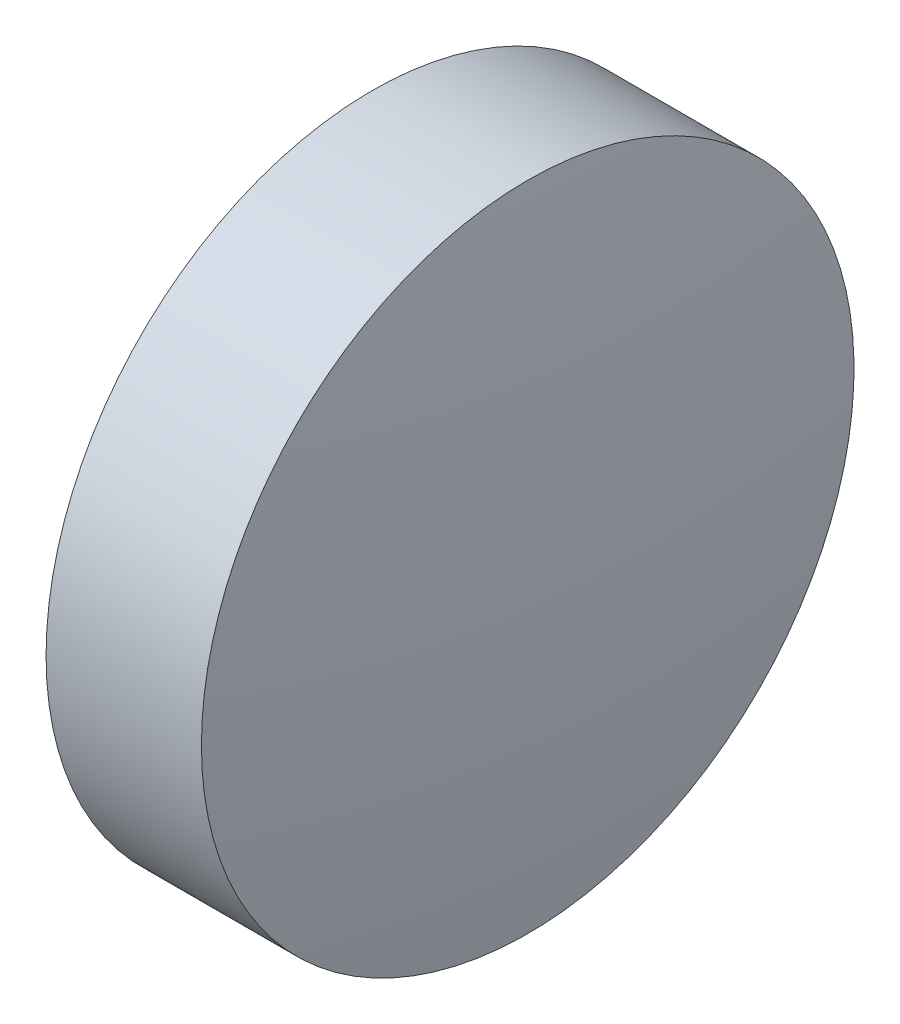
ISO-10303-21;
HEADER;
FILE_DESCRIPTION(('STEP AP214'),'2;1');
FILE_NAME('part.step','',(''),(''),'','','');
FILE_SCHEMA(('AUTOMOTIVE_DESIGN { 1 0 10303 214 1 1 1 1 }'));
ENDSEC;
DATA;
#1=APPLICATION_CONTEXT('core data for automotive mechanical design processes');
#2=APPLICATION_PROTOCOL_DEFINITION('international standard','automotive_design',2000,#1);
#3=PRODUCT_CONTEXT('',#1,'mechanical');
#4=PRODUCT('Part','Part','',(#3));
#5=PRODUCT_RELATED_PRODUCT_CATEGORY('part','',(#4));
#6=PRODUCT_DEFINITION_FORMATION('','',#4);
#7=PRODUCT_DEFINITION_CONTEXT('part definition',#1,'design');
#8=PRODUCT_DEFINITION('design','',#6,#7);
#9=PRODUCT_DEFINITION_SHAPE('','',#8);
#10=(LENGTH_UNIT() NAMED_UNIT(*) SI_UNIT(.MILLI.,.METRE.));
#11=(NAMED_UNIT(*) PLANE_ANGLE_UNIT() SI_UNIT($,.RADIAN.));
#12=(NAMED_UNIT(*) SI_UNIT($,.STERADIAN.) SOLID_ANGLE_UNIT());
#13=UNCERTAINTY_MEASURE_WITH_UNIT(LENGTH_MEASURE(1.E-05),#10,'distance_accuracy_value','');
#14=(GEOMETRIC_REPRESENTATION_CONTEXT(3) GLOBAL_UNCERTAINTY_ASSIGNED_CONTEXT((#13)) GLOBAL_UNIT_ASSIGNED_CONTEXT((#10,
#11,#12)) REPRESENTATION_CONTEXT('',''));
#15=CARTESIAN_POINT('',(0.,0.,0.));
#16=DIRECTION('',(0.,0.,1.));
#17=DIRECTION('',(1.,0.,0.));
#18=AXIS2_PLACEMENT_3D('',#15,#16,#17);
#19=CARTESIAN_POINT('',(380.384190913639,121.052591535613,0.));
#20=DIRECTION('',(-1.,0.,0.));
#21=DIRECTION('',(0.,1.,0.));
#22=AXIS2_PLACEMENT_3D('',#19,#20,#21);
#23=SPHERICAL_SURFACE('',#22,22.6611363636365);
#24=CARTESIAN_POINT('',(402.825327277275,121.052591535614,0.));
#25=DIRECTION('',(-1.,0.,0.));
#26=DIRECTION('',(0.,0.,1.));
#27=AXIS2_PLACEMENT_3D('',#24,#25,#26);
#28=CIRCLE('',#27,3.15);
#29=CARTESIAN_POINT('',(402.825327277275,121.052591535614,3.15));
#30=VERTEX_POINT('',#29);
#31=EDGE_CURVE('E10',#30,#30,#28,.T.);
#32=ORIENTED_EDGE('',*,*,#31,.F.);
#33=EDGE_LOOP('',(#32));
#34=FACE_BOUND('',#33,.T.);
#35=ADVANCED_FACE('F35',(#34),#23,.T.);
#36=CARTESIAN_POINT('',(400.464689188526,121.052591535614,0.));
#37=DIRECTION('',(-1.,0.,0.));
#38=DIRECTION('',(0.,0.,1.));
#39=AXIS2_PLACEMENT_3D('',#36,#37,#38);
#40=CYLINDRICAL_SURFACE('',#39,3.15);
#41=CARTESIAN_POINT('',(401.325327277275,121.052591535614,0.));
#42=DIRECTION('',(-1.,0.,0.));
#43=DIRECTION('',(0.,0.,1.));
#44=AXIS2_PLACEMENT_3D('',#41,#42,#43);
#45=CIRCLE('',#44,3.15);
#46=CARTESIAN_POINT('',(401.325327277275,121.052591535614,3.15));
#47=VERTEX_POINT('',#46);
#48=EDGE_CURVE('E41',#47,#47,#45,.T.);
#49=ORIENTED_EDGE('',*,*,#48,.F.);
#50=EDGE_LOOP('',(#49));
#51=FACE_BOUND('',#50,.T.);
#52=ORIENTED_EDGE('',*,*,#31,.T.);
#53=EDGE_LOOP('',(#52));
#54=FACE_BOUND('',#53,.T.);
#55=ADVANCED_FACE('F49',(#51,#54),#40,.T.);
#56=CARTESIAN_POINT('',(401.325327277275,121.052591535614,0.));
#57=DIRECTION('',(1.,0.,0.));
#58=DIRECTION('',(0.,0.,-1.));
#59=AXIS2_PLACEMENT_3D('',#56,#57,#58);
#60=PLANE('',#59);
#61=ORIENTED_EDGE('',*,*,#48,.T.);
#62=EDGE_LOOP('',(#61));
#63=FACE_BOUND('',#62,.T.);
#64=ADVANCED_FACE('F47',(#63),#60,.F.);
#65=CLOSED_SHELL('',(#35,#55,#64));
#66=MANIFOLD_SOLID_BREP('B2',#65);
#67=ADVANCED_BREP_SHAPE_REPRESENTATION('',(#18,#66),#14);
#68=SHAPE_DEFINITION_REPRESENTATION(#9,#67);
ENDSEC;
END-ISO-10303-21;
